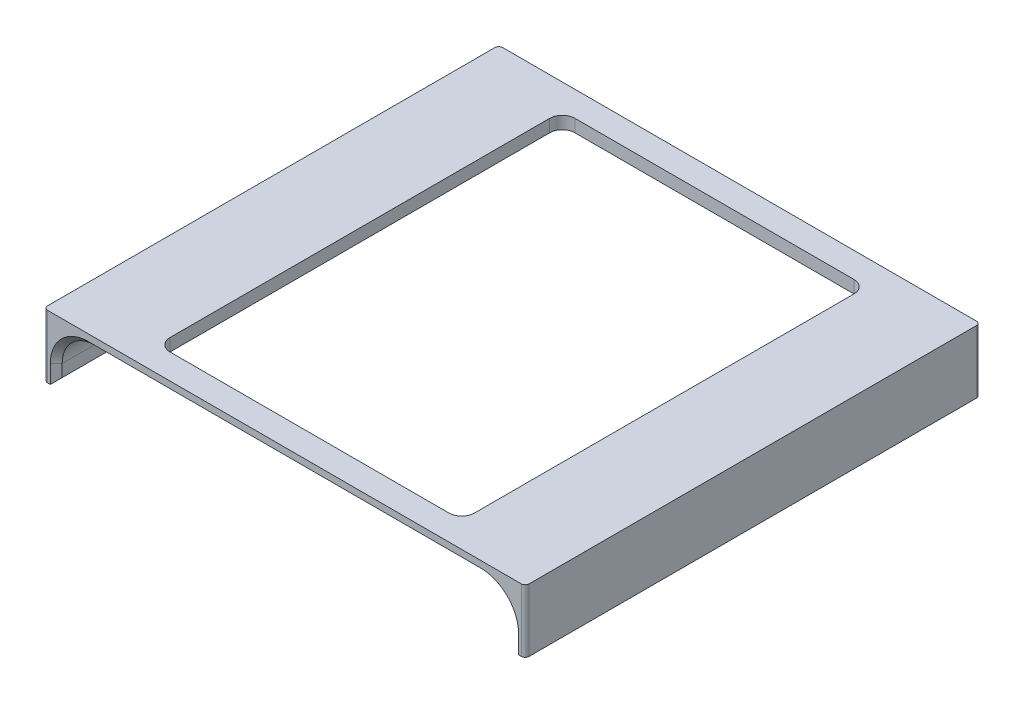
ISO-10303-21;
HEADER;
FILE_DESCRIPTION(('STEP AP214'),'2;1');
FILE_NAME('part.step','',(''),(''),'','','');
FILE_SCHEMA(('AUTOMOTIVE_DESIGN { 1 0 10303 214 1 1 1 1 }'));
ENDSEC;
DATA;
#1=APPLICATION_CONTEXT('core data for automotive mechanical design processes');
#2=APPLICATION_PROTOCOL_DEFINITION('international standard','automotive_design',2000,#1);
#3=PRODUCT_CONTEXT('',#1,'mechanical');
#4=PRODUCT('Part','Part','',(#3));
#5=PRODUCT_RELATED_PRODUCT_CATEGORY('part','',(#4));
#6=PRODUCT_DEFINITION_FORMATION('','',#4);
#7=PRODUCT_DEFINITION_CONTEXT('part definition',#1,'design');
#8=PRODUCT_DEFINITION('design','',#6,#7);
#9=PRODUCT_DEFINITION_SHAPE('','',#8);
#10=(LENGTH_UNIT() NAMED_UNIT(*) SI_UNIT(.MILLI.,.METRE.));
#11=(NAMED_UNIT(*) PLANE_ANGLE_UNIT() SI_UNIT($,.RADIAN.));
#12=(NAMED_UNIT(*) SI_UNIT($,.STERADIAN.) SOLID_ANGLE_UNIT());
#13=UNCERTAINTY_MEASURE_WITH_UNIT(LENGTH_MEASURE(1.E-05),#10,'distance_accuracy_value','');
#14=(GEOMETRIC_REPRESENTATION_CONTEXT(3) GLOBAL_UNCERTAINTY_ASSIGNED_CONTEXT((#13)) GLOBAL_UNIT_ASSIGNED_CONTEXT((#10,
#11,#12)) REPRESENTATION_CONTEXT('',''));
#15=CARTESIAN_POINT('',(0.,0.,0.));
#16=DIRECTION('',(0.,0.,1.));
#17=DIRECTION('',(1.,0.,0.));
#18=AXIS2_PLACEMENT_3D('',#15,#16,#17);
#19=CARTESIAN_POINT('',(0.,0.,0.));
#20=DIRECTION('',(0.,1.,0.));
#21=DIRECTION('',(0.,0.,1.));
#22=AXIS2_PLACEMENT_3D('',#19,#20,#21);
#23=PLANE('',#22);
#24=CARTESIAN_POINT('',(-35.2425,0.,-47.9425));
#25=DIRECTION('',(0.,1.,0.));
#26=DIRECTION('',(0.,0.,1.));
#27=AXIS2_PLACEMENT_3D('',#24,#25,#26);
#28=CIRCLE('',#27,3.17499999999999);
#29=CARTESIAN_POINT('',(-35.2425,0.,-51.1175));
#30=VERTEX_POINT('',#29);
#31=CARTESIAN_POINT('',(-38.4175,0.,-47.9425));
#32=VERTEX_POINT('',#31);
#33=EDGE_CURVE('E256',#30,#32,#28,.T.);
#34=ORIENTED_EDGE('',*,*,#33,.T.);
#35=DIRECTION('',(0.,0.,1.));
#36=VECTOR('',#35,1.);
#37=CARTESIAN_POINT('',(-38.4175,0.,0.));
#38=LINE('',#37,#36);
#39=CARTESIAN_POINT('',(-38.4175,0.,47.9425));
#40=VERTEX_POINT('',#39);
#41=EDGE_CURVE('E275',#32,#40,#38,.T.);
#42=ORIENTED_EDGE('',*,*,#41,.T.);
#43=CARTESIAN_POINT('',(-35.2425,0.,47.9425));
#44=DIRECTION('',(0.,1.,0.));
#45=DIRECTION('',(0.,0.,1.));
#46=AXIS2_PLACEMENT_3D('',#43,#44,#45);
#47=CIRCLE('',#46,3.17499999999999);
#48=CARTESIAN_POINT('',(-35.2425,0.,51.1175));
#49=VERTEX_POINT('',#48);
#50=EDGE_CURVE('E278',#40,#49,#47,.T.);
#51=ORIENTED_EDGE('',*,*,#50,.T.);
#52=DIRECTION('',(1.,0.,0.));
#53=VECTOR('',#52,1.);
#54=CARTESIAN_POINT('',(0.,0.,51.1175));
#55=LINE('',#54,#53);
#56=CARTESIAN_POINT('',(35.2425,0.,51.1175));
#57=VERTEX_POINT('',#56);
#58=EDGE_CURVE('E319',#49,#57,#55,.T.);
#59=ORIENTED_EDGE('',*,*,#58,.T.);
#60=CARTESIAN_POINT('',(35.2425,0.,47.9425));
#61=DIRECTION('',(0.,1.,0.));
#62=DIRECTION('',(0.,0.,1.));
#63=AXIS2_PLACEMENT_3D('',#60,#61,#62);
#64=CIRCLE('',#63,3.17499999999999);
#65=CARTESIAN_POINT('',(38.4175,0.,47.9425));
#66=VERTEX_POINT('',#65);
#67=EDGE_CURVE('E316',#57,#66,#64,.T.);
#68=ORIENTED_EDGE('',*,*,#67,.T.);
#69=DIRECTION('',(0.,0.,1.));
#70=VECTOR('',#69,1.);
#71=CARTESIAN_POINT('',(38.4175,0.,0.));
#72=LINE('',#71,#70);
#73=CARTESIAN_POINT('',(38.4175,0.,-47.9425));
#74=VERTEX_POINT('',#73);
#75=EDGE_CURVE('E313',#74,#66,#72,.T.);
#76=ORIENTED_EDGE('',*,*,#75,.F.);
#77=CARTESIAN_POINT('',(35.2425,0.,-47.9425));
#78=DIRECTION('',(0.,1.,0.));
#79=DIRECTION('',(0.,0.,1.));
#80=AXIS2_PLACEMENT_3D('',#77,#78,#79);
#81=CIRCLE('',#80,3.17499999999999);
#82=CARTESIAN_POINT('',(35.2425,0.,-51.1175));
#83=VERTEX_POINT('',#82);
#84=EDGE_CURVE('E311',#83,#74,#81,.F.);
#85=ORIENTED_EDGE('',*,*,#84,.F.);
#86=DIRECTION('',(1.,0.,0.));
#87=VECTOR('',#86,1.);
#88=CARTESIAN_POINT('',(0.,0.,-51.1175));
#89=LINE('',#88,#87);
#90=EDGE_CURVE('E308',#30,#83,#89,.T.);
#91=ORIENTED_EDGE('',*,*,#90,.F.);
#92=EDGE_LOOP('',(#34,#42,#51,#59,#68,#76,#85,#91));
#93=FACE_BOUND('',#92,.T.);
#94=DIRECTION('',(0.,0.,1.));
#95=VECTOR('',#94,1.);
#96=CARTESIAN_POINT('',(49.53254,0.,0.));
#97=LINE('',#96,#95);
#98=CARTESIAN_POINT('',(49.53254,0.,-55.9675));
#99=VERTEX_POINT('',#98);
#100=CARTESIAN_POINT('',(49.53254,0.,55.9675));
#101=VERTEX_POINT('',#100);
#102=EDGE_CURVE('E341',#99,#101,#97,.T.);
#103=ORIENTED_EDGE('',*,*,#102,.T.);
#104=DIRECTION('',(-1.,0.,0.));
#105=VECTOR('',#104,1.);
#106=CARTESIAN_POINT('',(0.,0.,55.9675));
#107=LINE('',#106,#105);
#108=CARTESIAN_POINT('',(-49.53254,0.,55.9675));
#109=VERTEX_POINT('',#108);
#110=EDGE_CURVE('E374',#101,#109,#107,.T.);
#111=ORIENTED_EDGE('',*,*,#110,.T.);
#112=DIRECTION('',(0.,0.,1.));
#113=VECTOR('',#112,1.);
#114=CARTESIAN_POINT('',(-49.53254,0.,-57.4675));
#115=LINE('',#114,#113);
#116=CARTESIAN_POINT('',(-49.53254,0.,-55.9675));
#117=VERTEX_POINT('',#116);
#118=EDGE_CURVE('E344',#109,#117,#115,.F.);
#119=ORIENTED_EDGE('',*,*,#118,.T.);
#120=DIRECTION('',(1.,0.,0.));
#121=VECTOR('',#120,1.);
#122=CARTESIAN_POINT('',(49.53254,0.,-55.9675));
#123=LINE('',#122,#121);
#124=EDGE_CURVE('E372',#117,#99,#123,.T.);
#125=ORIENTED_EDGE('',*,*,#124,.T.);
#126=EDGE_LOOP('',(#103,#111,#119,#125));
#127=FACE_BOUND('',#126,.T.);
#128=ADVANCED_FACE('F63',(#93,#127),#23,.F.);
#129=CARTESIAN_POINT('',(0.,3.175,-57.4675));
#130=DIRECTION('',(0.,0.,-1.));
#131=DIRECTION('',(-1.,0.,0.));
#132=AXIS2_PLACEMENT_3D('',#129,#130,#131);
#133=PLANE('',#132);
#134=DIRECTION('',(-1.,0.,0.));
#135=VECTOR('',#134,1.);
#136=CARTESIAN_POINT('',(0.,-12.7,-57.4675));
#137=LINE('',#136,#135);
#138=CARTESIAN_POINT('',(-59.1326,-12.7,-57.4675));
#139=VERTEX_POINT('',#138);
#140=CARTESIAN_POINT('',(-59.8076,-12.7,-57.4675));
#141=VERTEX_POINT('',#140);
#142=EDGE_CURVE('E435',#139,#141,#137,.T.);
#143=ORIENTED_EDGE('',*,*,#142,.T.);
#144=DIRECTION('',(0.,-1.,0.));
#145=VECTOR('',#144,1.);
#146=CARTESIAN_POINT('',(-59.8076,3.175,-57.4675));
#147=LINE('',#146,#145);
#148=CARTESIAN_POINT('',(-59.8076,3.175,-57.4675));
#149=VERTEX_POINT('',#148);
#150=EDGE_CURVE('E460',#141,#149,#147,.F.);
#151=ORIENTED_EDGE('',*,*,#150,.T.);
#152=DIRECTION('',(1.,0.,0.));
#153=VECTOR('',#152,1.);
#154=CARTESIAN_POINT('',(0.,3.175,-57.4675));
#155=LINE('',#154,#153);
#156=CARTESIAN_POINT('',(59.8076,3.175,-57.4675));
#157=VERTEX_POINT('',#156);
#158=EDGE_CURVE('E297',#149,#157,#155,.T.);
#159=ORIENTED_EDGE('',*,*,#158,.T.);
#160=DIRECTION('',(0.,-1.,0.));
#161=VECTOR('',#160,1.);
#162=CARTESIAN_POINT('',(59.8076,3.175,-57.4675));
#163=LINE('',#162,#161);
#164=CARTESIAN_POINT('',(59.8076,-12.7,-57.4675));
#165=VERTEX_POINT('',#164);
#166=EDGE_CURVE('E457',#157,#165,#163,.T.);
#167=ORIENTED_EDGE('',*,*,#166,.T.);
#168=DIRECTION('',(1.,0.,0.));
#169=VECTOR('',#168,1.);
#170=CARTESIAN_POINT('',(-2.51187959321441E-13,-12.7,-57.4674999999998));
#171=LINE('',#170,#169);
#172=CARTESIAN_POINT('',(59.1326,-12.7,-57.4675));
#173=VERTEX_POINT('',#172);
#174=EDGE_CURVE('E472',#173,#165,#171,.T.);
#175=ORIENTED_EDGE('',*,*,#174,.F.);
#176=DIRECTION('',(0.,1.,0.));
#177=VECTOR('',#176,1.);
#178=CARTESIAN_POINT('',(59.1326,3.175,-57.4675));
#179=LINE('',#178,#177);
#180=CARTESIAN_POINT('',(59.1326,-8.10006,-57.4675));
#181=VERTEX_POINT('',#180);
#182=EDGE_CURVE('E396',#173,#181,#179,.T.);
#183=ORIENTED_EDGE('',*,*,#182,.T.);
#184=CARTESIAN_POINT('',(49.53254,-8.10006,-57.4675));
#185=DIRECTION('',(0.,0.,-1.));
#186=DIRECTION('',(-1.,0.,0.));
#187=AXIS2_PLACEMENT_3D('',#184,#185,#186);
#188=CIRCLE('',#187,9.60006);
#189=CARTESIAN_POINT('',(49.53254,1.5,-57.4675));
#190=VERTEX_POINT('',#189);
#191=EDGE_CURVE('E394',#181,#190,#188,.F.);
#192=ORIENTED_EDGE('',*,*,#191,.T.);
#193=DIRECTION('',(-1.,0.,0.));
#194=VECTOR('',#193,1.);
#195=CARTESIAN_POINT('',(-49.53254,1.5,-57.4675));
#196=LINE('',#195,#194);
#197=CARTESIAN_POINT('',(-49.53254,1.5,-57.4675));
#198=VERTEX_POINT('',#197);
#199=EDGE_CURVE('E392',#190,#198,#196,.T.);
#200=ORIENTED_EDGE('',*,*,#199,.T.);
#201=CARTESIAN_POINT('',(-49.53254,-8.10006,-57.4675));
#202=DIRECTION('',(0.,0.,-1.));
#203=DIRECTION('',(-1.,0.,0.));
#204=AXIS2_PLACEMENT_3D('',#201,#202,#203);
#205=CIRCLE('',#204,9.60006);
#206=CARTESIAN_POINT('',(-59.1326,-8.10006,-57.4675));
#207=VERTEX_POINT('',#206);
#208=EDGE_CURVE('E390',#198,#207,#205,.F.);
#209=ORIENTED_EDGE('',*,*,#208,.T.);
#210=DIRECTION('',(0.,-1.,0.));
#211=VECTOR('',#210,1.);
#212=CARTESIAN_POINT('',(-59.1326,-12.7,-57.4675));
#213=LINE('',#212,#211);
#214=EDGE_CURVE('E388',#207,#139,#213,.T.);
#215=ORIENTED_EDGE('',*,*,#214,.T.);
#216=EDGE_LOOP('',(#143,#151,#159,#167,#175,#183,#192,#200,#209,#215));
#217=FACE_BOUND('',#216,.T.);
#218=ADVANCED_FACE('F485',(#217),#133,.T.);
#219=CARTESIAN_POINT('',(-60.8076,3.175,0.));
#220=DIRECTION('',(1.,0.,0.));
#221=DIRECTION('',(0.,0.,-1.));
#222=AXIS2_PLACEMENT_3D('',#219,#220,#221);
#223=PLANE('',#222);
#224=DIRECTION('',(0.,0.,1.));
#225=VECTOR('',#224,1.);
#226=CARTESIAN_POINT('',(-60.8076,-12.7,0.));
#227=LINE('',#226,#225);
#228=CARTESIAN_POINT('',(-60.8076,-12.7,-56.4675));
#229=VERTEX_POINT('',#228);
#230=CARTESIAN_POINT('',(-60.8076,-12.7,56.4675));
#231=VERTEX_POINT('',#230);
#232=EDGE_CURVE('E476',#229,#231,#227,.T.);
#233=ORIENTED_EDGE('',*,*,#232,.T.);
#234=DIRECTION('',(0.,-1.,0.));
#235=VECTOR('',#234,1.);
#236=CARTESIAN_POINT('',(-60.8076,3.175,56.4675));
#237=LINE('',#236,#235);
#238=CARTESIAN_POINT('',(-60.8076,3.175,56.4675));
#239=VERTEX_POINT('',#238);
#240=EDGE_CURVE('E447',#231,#239,#237,.F.);
#241=ORIENTED_EDGE('',*,*,#240,.T.);
#242=DIRECTION('',(0.,0.,1.));
#243=VECTOR('',#242,1.);
#244=CARTESIAN_POINT('',(-60.8076,3.175,0.));
#245=LINE('',#244,#243);
#246=CARTESIAN_POINT('',(-60.8076,3.175,-56.4675));
#247=VERTEX_POINT('',#246);
#248=EDGE_CURVE('E300',#247,#239,#245,.T.);
#249=ORIENTED_EDGE('',*,*,#248,.F.);
#250=DIRECTION('',(0.,-1.,0.));
#251=VECTOR('',#250,1.);
#252=CARTESIAN_POINT('',(-60.8076,-12.7,-56.4675));
#253=LINE('',#252,#251);
#254=EDGE_CURVE('E444',#247,#229,#253,.T.);
#255=ORIENTED_EDGE('',*,*,#254,.T.);
#256=EDGE_LOOP('',(#233,#241,#249,#255));
#257=FACE_BOUND('',#256,.T.);
#258=ADVANCED_FACE('F497',(#257),#223,.F.);
#259=CARTESIAN_POINT('',(-35.2425,3.175,-47.9425));
#260=DIRECTION('',(0.,-1.,0.));
#261=DIRECTION('',(0.,0.,-1.));
#262=AXIS2_PLACEMENT_3D('',#259,#260,#261);
#263=CYLINDRICAL_SURFACE('',#262,3.17499999999999);
#264=ORIENTED_EDGE('',*,*,#33,.F.);
#265=DIRECTION('',(0.,-1.,0.));
#266=VECTOR('',#265,1.);
#267=CARTESIAN_POINT('',(-35.2425,3.175,-51.1175));
#268=LINE('',#267,#266);
#269=CARTESIAN_POINT('',(-35.2425,3.175,-51.1175));
#270=VERTEX_POINT('',#269);
#271=EDGE_CURVE('E249',#270,#30,#268,.T.);
#272=ORIENTED_EDGE('',*,*,#271,.F.);
#273=CARTESIAN_POINT('',(-35.2425,3.175,-47.9425));
#274=DIRECTION('',(0.,1.,0.));
#275=DIRECTION('',(0.,0.,1.));
#276=AXIS2_PLACEMENT_3D('',#273,#274,#275);
#277=CIRCLE('',#276,3.17499999999999);
#278=CARTESIAN_POINT('',(-38.4175,3.175,-47.9425));
#279=VERTEX_POINT('',#278);
#280=EDGE_CURVE('E253',#270,#279,#277,.T.);
#281=ORIENTED_EDGE('',*,*,#280,.T.);
#282=DIRECTION('',(0.,-1.,0.));
#283=VECTOR('',#282,1.);
#284=CARTESIAN_POINT('',(-38.4175,3.175,-47.9425));
#285=LINE('',#284,#283);
#286=EDGE_CURVE('E306',#279,#32,#285,.T.);
#287=ORIENTED_EDGE('',*,*,#286,.T.);
#288=EDGE_LOOP('',(#264,#272,#281,#287));
#289=FACE_BOUND('',#288,.T.);
#290=ADVANCED_FACE('F251',(#289),#263,.F.);
#291=CARTESIAN_POINT('',(0.,3.175,-51.1175));
#292=DIRECTION('',(0.,0.,-1.));
#293=DIRECTION('',(-1.,0.,0.));
#294=AXIS2_PLACEMENT_3D('',#291,#292,#293);
#295=PLANE('',#294);
#296=ORIENTED_EDGE('',*,*,#90,.T.);
#297=DIRECTION('',(0.,-1.,0.));
#298=VECTOR('',#297,1.);
#299=CARTESIAN_POINT('',(35.2425,3.175,-51.1175));
#300=LINE('',#299,#298);
#301=CARTESIAN_POINT('',(35.2425,3.175,-51.1175));
#302=VERTEX_POINT('',#301);
#303=EDGE_CURVE('E260',#302,#83,#300,.T.);
#304=ORIENTED_EDGE('',*,*,#303,.F.);
#305=DIRECTION('',(1.,0.,0.));
#306=VECTOR('',#305,1.);
#307=CARTESIAN_POINT('',(0.,3.175,-51.1175));
#308=LINE('',#307,#306);
#309=EDGE_CURVE('E263',#270,#302,#308,.T.);
#310=ORIENTED_EDGE('',*,*,#309,.F.);
#311=ORIENTED_EDGE('',*,*,#271,.T.);
#312=EDGE_LOOP('',(#296,#304,#310,#311));
#313=FACE_BOUND('',#312,.T.);
#314=ADVANCED_FACE('F264',(#313),#295,.F.);
#315=CARTESIAN_POINT('',(35.2425,3.175,-47.9425));
#316=DIRECTION('',(0.,-1.,0.));
#317=DIRECTION('',(0.,0.,-1.));
#318=AXIS2_PLACEMENT_3D('',#315,#316,#317);
#319=CYLINDRICAL_SURFACE('',#318,3.17499999999999);
#320=ORIENTED_EDGE('',*,*,#84,.T.);
#321=DIRECTION('',(0.,-1.,0.));
#322=VECTOR('',#321,1.);
#323=CARTESIAN_POINT('',(38.4175,3.175,-47.9425));
#324=LINE('',#323,#322);
#325=CARTESIAN_POINT('',(38.4175,3.175,-47.9425));
#326=VERTEX_POINT('',#325);
#327=EDGE_CURVE('E333',#326,#74,#324,.T.);
#328=ORIENTED_EDGE('',*,*,#327,.F.);
#329=CARTESIAN_POINT('',(35.2425,3.175,-47.9425));
#330=DIRECTION('',(0.,1.,0.));
#331=DIRECTION('',(0.,0.,1.));
#332=AXIS2_PLACEMENT_3D('',#329,#330,#331);
#333=CIRCLE('',#332,3.17499999999999);
#334=EDGE_CURVE('E268',#302,#326,#333,.F.);
#335=ORIENTED_EDGE('',*,*,#334,.F.);
#336=ORIENTED_EDGE('',*,*,#303,.T.);
#337=EDGE_LOOP('',(#320,#328,#335,#336));
#338=FACE_BOUND('',#337,.T.);
#339=ADVANCED_FACE('F844',(#338),#319,.F.);
#340=CARTESIAN_POINT('',(38.4175,3.175,0.));
#341=DIRECTION('',(1.,0.,0.));
#342=DIRECTION('',(0.,0.,-1.));
#343=AXIS2_PLACEMENT_3D('',#340,#341,#342);
#344=PLANE('',#343);
#345=ORIENTED_EDGE('',*,*,#75,.T.);
#346=DIRECTION('',(0.,-1.,0.));
#347=VECTOR('',#346,1.);
#348=CARTESIAN_POINT('',(38.4175,3.175,47.9425));
#349=LINE('',#348,#347);
#350=CARTESIAN_POINT('',(38.4175,3.175,47.9425));
#351=VERTEX_POINT('',#350);
#352=EDGE_CURVE('E331',#351,#66,#349,.T.);
#353=ORIENTED_EDGE('',*,*,#352,.F.);
#354=DIRECTION('',(0.,0.,1.));
#355=VECTOR('',#354,1.);
#356=CARTESIAN_POINT('',(38.4175,3.175,0.));
#357=LINE('',#356,#355);
#358=EDGE_CURVE('E285',#326,#351,#357,.T.);
#359=ORIENTED_EDGE('',*,*,#358,.F.);
#360=ORIENTED_EDGE('',*,*,#327,.T.);
#361=EDGE_LOOP('',(#345,#353,#359,#360));
#362=FACE_BOUND('',#361,.T.);
#363=ADVANCED_FACE('F834',(#362),#344,.F.);
#364=CARTESIAN_POINT('',(35.2425,3.175,47.9425));
#365=DIRECTION('',(0.,-1.,0.));
#366=DIRECTION('',(0.,0.,-1.));
#367=AXIS2_PLACEMENT_3D('',#364,#365,#366);
#368=CYLINDRICAL_SURFACE('',#367,3.17499999999999);
#369=ORIENTED_EDGE('',*,*,#67,.F.);
#370=DIRECTION('',(0.,-1.,0.));
#371=VECTOR('',#370,1.);
#372=CARTESIAN_POINT('',(35.2425,3.175,51.1175));
#373=LINE('',#372,#371);
#374=CARTESIAN_POINT('',(35.2425,3.175,51.1175));
#375=VERTEX_POINT('',#374);
#376=EDGE_CURVE('E329',#375,#57,#373,.T.);
#377=ORIENTED_EDGE('',*,*,#376,.F.);
#378=CARTESIAN_POINT('',(35.2425,3.175,47.9425));
#379=DIRECTION('',(0.,1.,0.));
#380=DIRECTION('',(0.,0.,1.));
#381=AXIS2_PLACEMENT_3D('',#378,#379,#380);
#382=CIRCLE('',#381,3.17499999999999);
#383=EDGE_CURVE('E287',#375,#351,#382,.T.);
#384=ORIENTED_EDGE('',*,*,#383,.T.);
#385=ORIENTED_EDGE('',*,*,#352,.T.);
#386=EDGE_LOOP('',(#369,#377,#384,#385));
#387=FACE_BOUND('',#386,.T.);
#388=ADVANCED_FACE('F824',(#387),#368,.F.);
#389=CARTESIAN_POINT('',(0.,3.175,51.1175));
#390=DIRECTION('',(0.,0.,-1.));
#391=DIRECTION('',(-1.,0.,0.));
#392=AXIS2_PLACEMENT_3D('',#389,#390,#391);
#393=PLANE('',#392);
#394=ORIENTED_EDGE('',*,*,#58,.F.);
#395=DIRECTION('',(0.,-1.,0.));
#396=VECTOR('',#395,1.);
#397=CARTESIAN_POINT('',(-35.2425,3.175,51.1175));
#398=LINE('',#397,#396);
#399=CARTESIAN_POINT('',(-35.2425,3.175,51.1175));
#400=VERTEX_POINT('',#399);
#401=EDGE_CURVE('E327',#400,#49,#398,.T.);
#402=ORIENTED_EDGE('',*,*,#401,.F.);
#403=DIRECTION('',(1.,0.,0.));
#404=VECTOR('',#403,1.);
#405=CARTESIAN_POINT('',(0.,3.175,51.1175));
#406=LINE('',#405,#404);
#407=EDGE_CURVE('E290',#400,#375,#406,.T.);
#408=ORIENTED_EDGE('',*,*,#407,.T.);
#409=ORIENTED_EDGE('',*,*,#376,.T.);
#410=EDGE_LOOP('',(#394,#402,#408,#409));
#411=FACE_BOUND('',#410,.T.);
#412=ADVANCED_FACE('F814',(#411),#393,.T.);
#413=CARTESIAN_POINT('',(-35.2425,3.175,47.9425));
#414=DIRECTION('',(0.,-1.,0.));
#415=DIRECTION('',(0.,0.,-1.));
#416=AXIS2_PLACEMENT_3D('',#413,#414,#415);
#417=CYLINDRICAL_SURFACE('',#416,3.17499999999999);
#418=ORIENTED_EDGE('',*,*,#50,.F.);
#419=DIRECTION('',(0.,-1.,0.));
#420=VECTOR('',#419,1.);
#421=CARTESIAN_POINT('',(-38.4175,3.175,47.9425));
#422=LINE('',#421,#420);
#423=CARTESIAN_POINT('',(-38.4175,3.175,47.9425));
#424=VERTEX_POINT('',#423);
#425=EDGE_CURVE('E325',#424,#40,#422,.T.);
#426=ORIENTED_EDGE('',*,*,#425,.F.);
#427=CARTESIAN_POINT('',(-35.2425,3.175,47.9425));
#428=DIRECTION('',(0.,1.,0.));
#429=DIRECTION('',(0.,0.,1.));
#430=AXIS2_PLACEMENT_3D('',#427,#428,#429);
#431=CIRCLE('',#430,3.17499999999999);
#432=EDGE_CURVE('E293',#424,#400,#431,.T.);
#433=ORIENTED_EDGE('',*,*,#432,.T.);
#434=ORIENTED_EDGE('',*,*,#401,.T.);
#435=EDGE_LOOP('',(#418,#426,#433,#434));
#436=FACE_BOUND('',#435,.T.);
#437=ADVANCED_FACE('F802',(#436),#417,.F.);
#438=CARTESIAN_POINT('',(-38.4175,3.175,0.));
#439=DIRECTION('',(1.,0.,0.));
#440=DIRECTION('',(0.,0.,-1.));
#441=AXIS2_PLACEMENT_3D('',#438,#439,#440);
#442=PLANE('',#441);
#443=ORIENTED_EDGE('',*,*,#41,.F.);
#444=ORIENTED_EDGE('',*,*,#286,.F.);
#445=DIRECTION('',(0.,0.,1.));
#446=VECTOR('',#445,1.);
#447=CARTESIAN_POINT('',(-38.4175,3.175,0.));
#448=LINE('',#447,#446);
#449=EDGE_CURVE('E274',#279,#424,#448,.T.);
#450=ORIENTED_EDGE('',*,*,#449,.T.);
#451=ORIENTED_EDGE('',*,*,#425,.T.);
#452=EDGE_LOOP('',(#443,#444,#450,#451));
#453=FACE_BOUND('',#452,.T.);
#454=ADVANCED_FACE('F797',(#453),#442,.T.);
#455=CARTESIAN_POINT('',(0.,3.175,57.4675));
#456=DIRECTION('',(0.,0.,-1.));
#457=DIRECTION('',(-1.,0.,0.));
#458=AXIS2_PLACEMENT_3D('',#455,#456,#457);
#459=PLANE('',#458);
#460=DIRECTION('',(1.,0.,0.));
#461=VECTOR('',#460,1.);
#462=CARTESIAN_POINT('',(0.,3.175,57.4675));
#463=LINE('',#462,#461);
#464=CARTESIAN_POINT('',(-59.8076,3.175,57.4675));
#465=VERTEX_POINT('',#464);
#466=CARTESIAN_POINT('',(59.8076,3.175,57.4675));
#467=VERTEX_POINT('',#466);
#468=EDGE_CURVE('E303',#465,#467,#463,.T.);
#469=ORIENTED_EDGE('',*,*,#468,.F.);
#470=DIRECTION('',(0.,-1.,0.));
#471=VECTOR('',#470,1.);
#472=CARTESIAN_POINT('',(-59.8076,3.175,57.4675));
#473=LINE('',#472,#471);
#474=CARTESIAN_POINT('',(-59.8076,-12.7,57.4675));
#475=VERTEX_POINT('',#474);
#476=EDGE_CURVE('E437',#465,#475,#473,.T.);
#477=ORIENTED_EDGE('',*,*,#476,.T.);
#478=DIRECTION('',(-1.,0.,0.));
#479=VECTOR('',#478,1.);
#480=CARTESIAN_POINT('',(0.,-12.7,57.4675));
#481=LINE('',#480,#479);
#482=CARTESIAN_POINT('',(-59.1326,-12.7,57.4675));
#483=VERTEX_POINT('',#482);
#484=EDGE_CURVE('E473',#483,#475,#481,.T.);
#485=ORIENTED_EDGE('',*,*,#484,.F.);
#486=DIRECTION('',(0.,1.,0.));
#487=VECTOR('',#486,1.);
#488=CARTESIAN_POINT('',(-59.1326,3.175,57.4675));
#489=LINE('',#488,#487);
#490=CARTESIAN_POINT('',(-59.1326,-8.10006,57.4675));
#491=VERTEX_POINT('',#490);
#492=EDGE_CURVE('E358',#483,#491,#489,.T.);
#493=ORIENTED_EDGE('',*,*,#492,.T.);
#494=CARTESIAN_POINT('',(-49.53254,-8.10006,57.4675));
#495=DIRECTION('',(0.,0.,-1.));
#496=DIRECTION('',(-1.,0.,0.));
#497=AXIS2_PLACEMENT_3D('',#494,#495,#496);
#498=CIRCLE('',#497,9.60006);
#499=CARTESIAN_POINT('',(-49.53254,1.5,57.4675));
#500=VERTEX_POINT('',#499);
#501=EDGE_CURVE('E356',#491,#500,#498,.T.);
#502=ORIENTED_EDGE('',*,*,#501,.T.);
#503=DIRECTION('',(1.,0.,0.));
#504=VECTOR('',#503,1.);
#505=CARTESIAN_POINT('',(0.,1.5,57.4675));
#506=LINE('',#505,#504);
#507=CARTESIAN_POINT('',(49.53254,1.5,57.4675));
#508=VERTEX_POINT('',#507);
#509=EDGE_CURVE('E354',#500,#508,#506,.T.);
#510=ORIENTED_EDGE('',*,*,#509,.T.);
#511=CARTESIAN_POINT('',(49.53254,-8.10006,57.4675));
#512=DIRECTION('',(0.,0.,-1.));
#513=DIRECTION('',(-1.,0.,0.));
#514=AXIS2_PLACEMENT_3D('',#511,#512,#513);
#515=CIRCLE('',#514,9.60006);
#516=CARTESIAN_POINT('',(59.1326,-8.10006,57.4675));
#517=VERTEX_POINT('',#516);
#518=EDGE_CURVE('E352',#508,#517,#515,.T.);
#519=ORIENTED_EDGE('',*,*,#518,.T.);
#520=DIRECTION('',(0.,-1.,0.));
#521=VECTOR('',#520,1.);
#522=CARTESIAN_POINT('',(59.1326,-12.7,57.4675));
#523=LINE('',#522,#521);
#524=CARTESIAN_POINT('',(59.1326,-12.7,57.4675));
#525=VERTEX_POINT('',#524);
#526=EDGE_CURVE('E350',#517,#525,#523,.T.);
#527=ORIENTED_EDGE('',*,*,#526,.T.);
#528=DIRECTION('',(1.,0.,0.));
#529=VECTOR('',#528,1.);
#530=CARTESIAN_POINT('',(2.51187959321441E-13,-12.7,57.4675000000003));
#531=LINE('',#530,#529);
#532=CARTESIAN_POINT('',(59.8076,-12.7,57.4675));
#533=VERTEX_POINT('',#532);
#534=EDGE_CURVE('E281',#525,#533,#531,.T.);
#535=ORIENTED_EDGE('',*,*,#534,.T.);
#536=DIRECTION('',(0.,-1.,0.));
#537=VECTOR('',#536,1.);
#538=CARTESIAN_POINT('',(59.8076,3.175,57.4675));
#539=LINE('',#538,#537);
#540=EDGE_CURVE('E400',#533,#467,#539,.F.);
#541=ORIENTED_EDGE('',*,*,#540,.T.);
#542=EDGE_LOOP('',(#469,#477,#485,#493,#502,#510,#519,#527,#535,#541));
#543=FACE_BOUND('',#542,.T.);
#544=ADVANCED_FACE('F505',(#543),#459,.F.);
#545=CARTESIAN_POINT('',(0.,3.175,0.));
#546=DIRECTION('',(0.,1.,0.));
#547=DIRECTION('',(0.,0.,1.));
#548=AXIS2_PLACEMENT_3D('',#545,#546,#547);
#549=PLANE('',#548);
#550=ORIENTED_EDGE('',*,*,#280,.F.);
#551=ORIENTED_EDGE('',*,*,#309,.T.);
#552=ORIENTED_EDGE('',*,*,#334,.T.);
#553=ORIENTED_EDGE('',*,*,#358,.T.);
#554=ORIENTED_EDGE('',*,*,#383,.F.);
#555=ORIENTED_EDGE('',*,*,#407,.F.);
#556=ORIENTED_EDGE('',*,*,#432,.F.);
#557=ORIENTED_EDGE('',*,*,#449,.F.);
#558=EDGE_LOOP('',(#550,#551,#552,#553,#554,#555,#556,#557));
#559=FACE_BOUND('',#558,.T.);
#560=ORIENTED_EDGE('',*,*,#248,.T.);
#561=CARTESIAN_POINT('',(-59.8076,3.175,56.4675));
#562=DIRECTION('',(0.,1.,0.));
#563=DIRECTION('',(0.,0.,1.));
#564=AXIS2_PLACEMENT_3D('',#561,#562,#563);
#565=CIRCLE('',#564,1.);
#566=EDGE_CURVE('E455',#239,#465,#565,.T.);
#567=ORIENTED_EDGE('',*,*,#566,.T.);
#568=ORIENTED_EDGE('',*,*,#468,.T.);
#569=CARTESIAN_POINT('',(59.8076,3.175,56.4675));
#570=DIRECTION('',(0.,1.,0.));
#571=DIRECTION('',(0.,0.,1.));
#572=AXIS2_PLACEMENT_3D('',#569,#570,#571);
#573=CIRCLE('',#572,1.);
#574=CARTESIAN_POINT('',(60.8076,3.175,56.4675));
#575=VERTEX_POINT('',#574);
#576=EDGE_CURVE('E449',#467,#575,#573,.T.);
#577=ORIENTED_EDGE('',*,*,#576,.T.);
#578=DIRECTION('',(0.,0.,1.));
#579=VECTOR('',#578,1.);
#580=CARTESIAN_POINT('',(60.8076,3.175,-57.4675));
#581=LINE('',#580,#579);
#582=CARTESIAN_POINT('',(60.8076,3.175,-56.4675));
#583=VERTEX_POINT('',#582);
#584=EDGE_CURVE('E309',#583,#575,#581,.T.);
#585=ORIENTED_EDGE('',*,*,#584,.F.);
#586=CARTESIAN_POINT('',(59.8076,3.175,-56.4675));
#587=DIRECTION('',(0.,1.,0.));
#588=DIRECTION('',(0.,0.,1.));
#589=AXIS2_PLACEMENT_3D('',#586,#587,#588);
#590=CIRCLE('',#589,1.);
#591=EDGE_CURVE('E451',#583,#157,#590,.T.);
#592=ORIENTED_EDGE('',*,*,#591,.T.);
#593=ORIENTED_EDGE('',*,*,#158,.F.);
#594=CARTESIAN_POINT('',(-59.8076,3.175,-56.4675));
#595=DIRECTION('',(0.,1.,0.));
#596=DIRECTION('',(0.,0.,1.));
#597=AXIS2_PLACEMENT_3D('',#594,#595,#596);
#598=CIRCLE('',#597,1.);
#599=EDGE_CURVE('E453',#149,#247,#598,.T.);
#600=ORIENTED_EDGE('',*,*,#599,.T.);
#601=EDGE_LOOP('',(#560,#567,#568,#577,#585,#592,#593,#600));
#602=FACE_BOUND('',#601,.T.);
#603=ADVANCED_FACE('F270',(#559,#602),#549,.T.);
#604=CARTESIAN_POINT('',(60.8076,3.175,-57.4675));
#605=DIRECTION('',(1.,0.,0.));
#606=DIRECTION('',(0.,0.,-1.));
#607=AXIS2_PLACEMENT_3D('',#604,#605,#606);
#608=PLANE('',#607);
#609=DIRECTION('',(0.,0.,1.));
#610=VECTOR('',#609,1.);
#611=CARTESIAN_POINT('',(60.8076,-12.7,0.));
#612=LINE('',#611,#610);
#613=CARTESIAN_POINT('',(60.8076,-12.7,-56.4675));
#614=VERTEX_POINT('',#613);
#615=CARTESIAN_POINT('',(60.8076,-12.7,56.4675));
#616=VERTEX_POINT('',#615);
#617=EDGE_CURVE('E465',#614,#616,#612,.T.);
#618=ORIENTED_EDGE('',*,*,#617,.F.);
#619=DIRECTION('',(0.,-1.,0.));
#620=VECTOR('',#619,1.);
#621=CARTESIAN_POINT('',(60.8076,3.175,-56.4675));
#622=LINE('',#621,#620);
#623=EDGE_CURVE('E12',#614,#583,#622,.F.);
#624=ORIENTED_EDGE('',*,*,#623,.T.);
#625=ORIENTED_EDGE('',*,*,#584,.T.);
#626=DIRECTION('',(0.,-1.,0.));
#627=VECTOR('',#626,1.);
#628=CARTESIAN_POINT('',(60.8076,-12.7,56.4675));
#629=LINE('',#628,#627);
#630=EDGE_CURVE('E71',#575,#616,#629,.T.);
#631=ORIENTED_EDGE('',*,*,#630,.T.);
#632=EDGE_LOOP('',(#618,#624,#625,#631));
#633=FACE_BOUND('',#632,.T.);
#634=ADVANCED_FACE('F464',(#633),#608,.T.);
#635=CARTESIAN_POINT('',(57.6326,-12.7,0.));
#636=DIRECTION('',(-1.,0.,0.));
#637=DIRECTION('',(0.,0.,1.));
#638=AXIS2_PLACEMENT_3D('',#635,#636,#637);
#639=PLANE('',#638);
#640=DIRECTION('',(0.,0.,1.));
#641=VECTOR('',#640,1.);
#642=CARTESIAN_POINT('',(57.6326,-11.2,57.4675));
#643=LINE('',#642,#641);
#644=CARTESIAN_POINT('',(57.6326,-11.2,-55.9675));
#645=VERTEX_POINT('',#644);
#646=CARTESIAN_POINT('',(57.6326,-11.2,55.9675));
#647=VERTEX_POINT('',#646);
#648=EDGE_CURVE('E382',#645,#647,#643,.T.);
#649=ORIENTED_EDGE('',*,*,#648,.T.);
#650=DIRECTION('',(0.,1.,0.));
#651=VECTOR('',#650,1.);
#652=CARTESIAN_POINT('',(57.6326,-8.10006,55.9675));
#653=LINE('',#652,#651);
#654=CARTESIAN_POINT('',(57.6326,-8.10006,55.9675));
#655=VERTEX_POINT('',#654);
#656=EDGE_CURVE('E384',#647,#655,#653,.T.);
#657=ORIENTED_EDGE('',*,*,#656,.T.);
#658=DIRECTION('',(0.,0.,1.));
#659=VECTOR('',#658,1.);
#660=CARTESIAN_POINT('',(57.6326,-8.10006,0.));
#661=LINE('',#660,#659);
#662=CARTESIAN_POINT('',(57.6326,-8.10006,-55.9675));
#663=VERTEX_POINT('',#662);
#664=EDGE_CURVE('E347',#655,#663,#661,.F.);
#665=ORIENTED_EDGE('',*,*,#664,.T.);
#666=DIRECTION('',(0.,-1.,0.));
#667=VECTOR('',#666,1.);
#668=CARTESIAN_POINT('',(57.6326,-12.7,-55.9675));
#669=LINE('',#668,#667);
#670=EDGE_CURVE('E380',#663,#645,#669,.T.);
#671=ORIENTED_EDGE('',*,*,#670,.T.);
#672=EDGE_LOOP('',(#649,#657,#665,#671));
#673=FACE_BOUND('',#672,.T.);
#674=ADVANCED_FACE('F527',(#673),#639,.T.);
#675=CARTESIAN_POINT('',(0.,-12.7,0.));
#676=DIRECTION('',(0.,1.,0.));
#677=DIRECTION('',(0.,0.,1.));
#678=AXIS2_PLACEMENT_3D('',#675,#676,#677);
#679=PLANE('',#678);
#680=ORIENTED_EDGE('',*,*,#174,.T.);
#681=CARTESIAN_POINT('',(59.8076,-12.7,-56.4675));
#682=DIRECTION('',(0.,1.,0.));
#683=DIRECTION('',(0.,0.,1.));
#684=AXIS2_PLACEMENT_3D('',#681,#682,#683);
#685=CIRCLE('',#684,1.);
#686=EDGE_CURVE('E86',#165,#614,#685,.F.);
#687=ORIENTED_EDGE('',*,*,#686,.T.);
#688=ORIENTED_EDGE('',*,*,#617,.T.);
#689=CARTESIAN_POINT('',(59.8076,-12.7,56.4675));
#690=DIRECTION('',(0.,1.,0.));
#691=DIRECTION('',(0.,0.,1.));
#692=AXIS2_PLACEMENT_3D('',#689,#690,#691);
#693=CIRCLE('',#692,1.);
#694=EDGE_CURVE('E78',#616,#533,#693,.F.);
#695=ORIENTED_EDGE('',*,*,#694,.T.);
#696=ORIENTED_EDGE('',*,*,#534,.F.);
#697=DIRECTION('',(0.,0.,-1.));
#698=VECTOR('',#697,1.);
#699=CARTESIAN_POINT('',(59.1326,-12.7,-57.4675));
#700=LINE('',#699,#698);
#701=EDGE_CURVE('E386',#525,#173,#700,.T.);
#702=ORIENTED_EDGE('',*,*,#701,.T.);
#703=EDGE_LOOP('',(#680,#687,#688,#695,#696,#702));
#704=FACE_BOUND('',#703,.T.);
#705=ADVANCED_FACE('F469',(#704),#679,.F.);
#706=CARTESIAN_POINT('',(-57.6326,-12.7,0.));
#707=DIRECTION('',(-1.,0.,0.));
#708=DIRECTION('',(0.,0.,1.));
#709=AXIS2_PLACEMENT_3D('',#706,#707,#708);
#710=PLANE('',#709);
#711=DIRECTION('',(0.,0.,1.));
#712=VECTOR('',#711,1.);
#713=CARTESIAN_POINT('',(-57.6326,-8.10006,57.4675));
#714=LINE('',#713,#712);
#715=CARTESIAN_POINT('',(-57.6326,-8.10006,-55.9675));
#716=VERTEX_POINT('',#715);
#717=CARTESIAN_POINT('',(-57.6326,-8.10006,55.9675));
#718=VERTEX_POINT('',#717);
#719=EDGE_CURVE('E259',#716,#718,#714,.T.);
#720=ORIENTED_EDGE('',*,*,#719,.T.);
#721=DIRECTION('',(0.,-1.,0.));
#722=VECTOR('',#721,1.);
#723=CARTESIAN_POINT('',(-57.6326,-12.7,55.9675));
#724=LINE('',#723,#722);
#725=CARTESIAN_POINT('',(-57.6326,-11.2,55.9675));
#726=VERTEX_POINT('',#725);
#727=EDGE_CURVE('E365',#718,#726,#724,.T.);
#728=ORIENTED_EDGE('',*,*,#727,.T.);
#729=DIRECTION('',(0.,0.,-1.));
#730=VECTOR('',#729,1.);
#731=CARTESIAN_POINT('',(-57.6326,-11.2,0.));
#732=LINE('',#731,#730);
#733=CARTESIAN_POINT('',(-57.6326,-11.2,-55.9675));
#734=VERTEX_POINT('',#733);
#735=EDGE_CURVE('E363',#726,#734,#732,.T.);
#736=ORIENTED_EDGE('',*,*,#735,.T.);
#737=DIRECTION('',(0.,1.,0.));
#738=VECTOR('',#737,1.);
#739=CARTESIAN_POINT('',(-57.6326,-8.10006,-55.9675));
#740=LINE('',#739,#738);
#741=EDGE_CURVE('E361',#734,#716,#740,.T.);
#742=ORIENTED_EDGE('',*,*,#741,.T.);
#743=EDGE_LOOP('',(#720,#728,#736,#742));
#744=FACE_BOUND('',#743,.T.);
#745=ADVANCED_FACE('F768',(#744),#710,.F.);
#746=CARTESIAN_POINT('',(0.,-12.7,0.));
#747=DIRECTION('',(0.,1.,0.));
#748=DIRECTION('',(0.,0.,1.));
#749=AXIS2_PLACEMENT_3D('',#746,#747,#748);
#750=PLANE('',#749);
#751=ORIENTED_EDGE('',*,*,#484,.T.);
#752=CARTESIAN_POINT('',(-59.8076,-12.7,56.4675));
#753=DIRECTION('',(0.,1.,0.));
#754=DIRECTION('',(0.,0.,1.));
#755=AXIS2_PLACEMENT_3D('',#752,#753,#754);
#756=CIRCLE('',#755,1.);
#757=EDGE_CURVE('E442',#475,#231,#756,.F.);
#758=ORIENTED_EDGE('',*,*,#757,.T.);
#759=ORIENTED_EDGE('',*,*,#232,.F.);
#760=CARTESIAN_POINT('',(-59.8076,-12.7,-56.4675));
#761=DIRECTION('',(0.,1.,0.));
#762=DIRECTION('',(0.,0.,1.));
#763=AXIS2_PLACEMENT_3D('',#760,#761,#762);
#764=CIRCLE('',#763,1.);
#765=EDGE_CURVE('E440',#229,#141,#764,.F.);
#766=ORIENTED_EDGE('',*,*,#765,.T.);
#767=ORIENTED_EDGE('',*,*,#142,.F.);
#768=DIRECTION('',(0.,0.,1.));
#769=VECTOR('',#768,1.);
#770=CARTESIAN_POINT('',(-59.1326,-12.7,0.));
#771=LINE('',#770,#769);
#772=EDGE_CURVE('E398',#139,#483,#771,.T.);
#773=ORIENTED_EDGE('',*,*,#772,.T.);
#774=EDGE_LOOP('',(#751,#758,#759,#766,#767,#773));
#775=FACE_BOUND('',#774,.T.);
#776=ADVANCED_FACE('F581',(#775),#750,.F.);
#777=CARTESIAN_POINT('',(-49.53254,-8.10006,0.));
#778=DIRECTION('',(0.,0.,-1.));
#779=DIRECTION('',(-1.,0.,0.));
#780=AXIS2_PLACEMENT_3D('',#777,#778,#779);
#781=CYLINDRICAL_SURFACE('',#780,8.10006);
#782=ORIENTED_EDGE('',*,*,#118,.F.);
#783=CARTESIAN_POINT('',(-49.53254,-8.10006,55.9675));
#784=DIRECTION('',(0.,0.,-1.));
#785=DIRECTION('',(-1.,0.,0.));
#786=AXIS2_PLACEMENT_3D('',#783,#784,#785);
#787=CIRCLE('',#786,8.10006);
#788=EDGE_CURVE('E370',#109,#718,#787,.F.);
#789=ORIENTED_EDGE('',*,*,#788,.T.);
#790=ORIENTED_EDGE('',*,*,#719,.F.);
#791=CARTESIAN_POINT('',(-49.53254,-8.10006,-55.9675));
#792=DIRECTION('',(0.,0.,-1.));
#793=DIRECTION('',(-1.,0.,0.));
#794=AXIS2_PLACEMENT_3D('',#791,#792,#793);
#795=CIRCLE('',#794,8.10006);
#796=EDGE_CURVE('E368',#716,#117,#795,.T.);
#797=ORIENTED_EDGE('',*,*,#796,.T.);
#798=EDGE_LOOP('',(#782,#789,#790,#797));
#799=FACE_BOUND('',#798,.T.);
#800=ADVANCED_FACE('F554',(#799),#781,.F.);
#801=CARTESIAN_POINT('',(49.53254,-8.10006,0.));
#802=DIRECTION('',(0.,0.,1.));
#803=DIRECTION('',(1.,0.,0.));
#804=AXIS2_PLACEMENT_3D('',#801,#802,#803);
#805=CYLINDRICAL_SURFACE('',#804,8.10006);
#806=ORIENTED_EDGE('',*,*,#664,.F.);
#807=CARTESIAN_POINT('',(49.53254,-8.10006,55.9675));
#808=DIRECTION('',(0.,0.,-1.));
#809=DIRECTION('',(-1.,0.,0.));
#810=AXIS2_PLACEMENT_3D('',#807,#808,#809);
#811=CIRCLE('',#810,8.10006);
#812=EDGE_CURVE('E378',#655,#101,#811,.F.);
#813=ORIENTED_EDGE('',*,*,#812,.T.);
#814=ORIENTED_EDGE('',*,*,#102,.F.);
#815=CARTESIAN_POINT('',(49.53254,-8.10006,-55.9675));
#816=DIRECTION('',(0.,0.,-1.));
#817=DIRECTION('',(-1.,0.,0.));
#818=AXIS2_PLACEMENT_3D('',#815,#816,#817);
#819=CIRCLE('',#818,8.10006);
#820=EDGE_CURVE('E376',#99,#663,#819,.T.);
#821=ORIENTED_EDGE('',*,*,#820,.T.);
#822=EDGE_LOOP('',(#806,#813,#814,#821));
#823=FACE_BOUND('',#822,.T.);
#824=ADVANCED_FACE('F530',(#823),#805,.F.);
#825=CARTESIAN_POINT('',(59.1326,3.175,-57.4675));
#826=DIRECTION('',(0.707106781186544,0.,0.707106781186551));
#827=DIRECTION('',(0.,1.,0.));
#828=AXIS2_PLACEMENT_3D('',#825,#826,#827);
#829=PLANE('',#828);
#830=DIRECTION('',(0.577350269189629,-0.577350269189624,-0.577350269189624));
#831=VECTOR('',#830,1.);
#832=CARTESIAN_POINT('',(53.8409333333333,-7.40833333333337,-52.1758333333334));
#833=LINE('',#832,#831);
#834=EDGE_CURVE('E429',#645,#173,#833,.T.);
#835=ORIENTED_EDGE('',*,*,#834,.F.);
#836=ORIENTED_EDGE('',*,*,#670,.F.);
#837=DIRECTION('',(-0.707106781186551,0.,0.707106781186544));
#838=VECTOR('',#837,1.);
#839=CARTESIAN_POINT('',(59.1326,-8.10006,-57.4675));
#840=LINE('',#839,#838);
#841=EDGE_CURVE('E432',#181,#663,#840,.T.);
#842=ORIENTED_EDGE('',*,*,#841,.F.);
#843=ORIENTED_EDGE('',*,*,#182,.F.);
#844=EDGE_LOOP('',(#835,#836,#842,#843));
#845=FACE_BOUND('',#844,.T.);
#846=ADVANCED_FACE('F546',(#845),#829,.F.);
#847=CARTESIAN_POINT('',(49.53254,-8.10006,-57.4675));
#848=DIRECTION('',(0.,0.,-1.));
#849=DIRECTION('',(-1.,0.,0.));
#850=AXIS2_PLACEMENT_3D('',#847,#848,#849);
#851=CONICAL_SURFACE('',#850,9.60006,0.785398163397453);
#852=ORIENTED_EDGE('',*,*,#841,.T.);
#853=ORIENTED_EDGE('',*,*,#820,.F.);
#854=DIRECTION('',(0.,-0.707106781186551,0.707106781186544));
#855=VECTOR('',#854,1.);
#856=CARTESIAN_POINT('',(49.53254,1.5,-57.4675));
#857=LINE('',#856,#855);
#858=EDGE_CURVE('E426',#190,#99,#857,.T.);
#859=ORIENTED_EDGE('',*,*,#858,.F.);
#860=ORIENTED_EDGE('',*,*,#191,.F.);
#861=EDGE_LOOP('',(#852,#853,#859,#860));
#862=FACE_BOUND('',#861,.T.);
#863=ADVANCED_FACE('F535',(#862),#851,.F.);
#864=CARTESIAN_POINT('',(57.6326,-11.2,0.));
#865=DIRECTION('',(-0.707106781186544,-0.707106781186551,0.));
#866=DIRECTION('',(0.,0.,-1.));
#867=AXIS2_PLACEMENT_3D('',#864,#865,#866);
#868=PLANE('',#867);
#869=ORIENTED_EDGE('',*,*,#834,.T.);
#870=ORIENTED_EDGE('',*,*,#701,.F.);
#871=DIRECTION('',(0.577350269189629,-0.577350269189624,0.577350269189624));
#872=VECTOR('',#871,1.);
#873=CARTESIAN_POINT('',(58.1326,-11.7,56.4675));
#874=LINE('',#873,#872);
#875=EDGE_CURVE('E423',#647,#525,#874,.T.);
#876=ORIENTED_EDGE('',*,*,#875,.F.);
#877=ORIENTED_EDGE('',*,*,#648,.F.);
#878=EDGE_LOOP('',(#869,#870,#876,#877));
#879=FACE_BOUND('',#878,.T.);
#880=ADVANCED_FACE('F516',(#879),#868,.T.);
#881=CARTESIAN_POINT('',(0.,0.,-55.9675));
#882=DIRECTION('',(0.,-0.707106781186544,-0.707106781186551));
#883=DIRECTION('',(-1.,0.,0.));
#884=AXIS2_PLACEMENT_3D('',#881,#882,#883);
#885=PLANE('',#884);
#886=ORIENTED_EDGE('',*,*,#858,.T.);
#887=ORIENTED_EDGE('',*,*,#124,.F.);
#888=DIRECTION('',(0.,-0.707106781186551,0.707106781186544));
#889=VECTOR('',#888,1.);
#890=CARTESIAN_POINT('',(-49.53254,1.5,-57.4675));
#891=LINE('',#890,#889);
#892=EDGE_CURVE('E420',#198,#117,#891,.T.);
#893=ORIENTED_EDGE('',*,*,#892,.F.);
#894=ORIENTED_EDGE('',*,*,#199,.F.);
#895=EDGE_LOOP('',(#886,#887,#893,#894));
#896=FACE_BOUND('',#895,.T.);
#897=ADVANCED_FACE('F541',(#896),#885,.T.);
#898=CARTESIAN_POINT('',(57.6326,-12.7,55.9675));
#899=DIRECTION('',(-0.707106781186544,0.,0.707106781186551));
#900=DIRECTION('',(0.,-1.,0.));
#901=AXIS2_PLACEMENT_3D('',#898,#899,#900);
#902=PLANE('',#901);
#903=ORIENTED_EDGE('',*,*,#875,.T.);
#904=ORIENTED_EDGE('',*,*,#526,.F.);
#905=DIRECTION('',(0.707106781186551,0.,0.707106781186544));
#906=VECTOR('',#905,1.);
#907=CARTESIAN_POINT('',(57.6326,-8.10006,55.9675));
#908=LINE('',#907,#906);
#909=EDGE_CURVE('E417',#655,#517,#908,.T.);
#910=ORIENTED_EDGE('',*,*,#909,.F.);
#911=ORIENTED_EDGE('',*,*,#656,.F.);
#912=EDGE_LOOP('',(#903,#904,#910,#911));
#913=FACE_BOUND('',#912,.T.);
#914=ADVANCED_FACE('F522',(#913),#902,.T.);
#915=CARTESIAN_POINT('',(-49.53254,-8.10006,-57.4675));
#916=DIRECTION('',(0.,0.,-1.));
#917=DIRECTION('',(-1.,0.,0.));
#918=AXIS2_PLACEMENT_3D('',#915,#916,#917);
#919=CONICAL_SURFACE('',#918,9.60006,0.785398163397452);
#920=ORIENTED_EDGE('',*,*,#892,.T.);
#921=ORIENTED_EDGE('',*,*,#796,.F.);
#922=DIRECTION('',(0.707106781186551,0.,0.707106781186544));
#923=VECTOR('',#922,1.);
#924=CARTESIAN_POINT('',(-59.1326,-8.10006,-57.4675));
#925=LINE('',#924,#923);
#926=EDGE_CURVE('E414',#207,#716,#925,.T.);
#927=ORIENTED_EDGE('',*,*,#926,.F.);
#928=ORIENTED_EDGE('',*,*,#208,.F.);
#929=EDGE_LOOP('',(#920,#921,#927,#928));
#930=FACE_BOUND('',#929,.T.);
#931=ADVANCED_FACE('F626',(#930),#919,.F.);
#932=CARTESIAN_POINT('',(49.53254,-8.10006,57.4675));
#933=DIRECTION('',(0.,0.,1.));
#934=DIRECTION('',(1.,0.,0.));
#935=AXIS2_PLACEMENT_3D('',#932,#933,#934);
#936=CONICAL_SURFACE('',#935,9.60006,0.785398163397453);
#937=ORIENTED_EDGE('',*,*,#909,.T.);
#938=ORIENTED_EDGE('',*,*,#518,.F.);
#939=DIRECTION('',(0.,0.70710678118655,0.707106781186545));
#940=VECTOR('',#939,1.);
#941=CARTESIAN_POINT('',(49.53254,0.,55.9675));
#942=LINE('',#941,#940);
#943=EDGE_CURVE('E411',#101,#508,#942,.T.);
#944=ORIENTED_EDGE('',*,*,#943,.F.);
#945=ORIENTED_EDGE('',*,*,#812,.F.);
#946=EDGE_LOOP('',(#937,#938,#944,#945));
#947=FACE_BOUND('',#946,.T.);
#948=ADVANCED_FACE('F619',(#947),#936,.F.);
#949=CARTESIAN_POINT('',(-57.6326,-12.7,-55.9675));
#950=DIRECTION('',(0.707106781186544,0.,-0.707106781186551));
#951=DIRECTION('',(0.,-1.,0.));
#952=AXIS2_PLACEMENT_3D('',#949,#950,#951);
#953=PLANE('',#952);
#954=ORIENTED_EDGE('',*,*,#926,.T.);
#955=ORIENTED_EDGE('',*,*,#741,.F.);
#956=DIRECTION('',(0.577350269189629,0.577350269189624,0.577350269189624));
#957=VECTOR('',#956,1.);
#958=CARTESIAN_POINT('',(-58.1326,-11.7,-56.4675));
#959=LINE('',#958,#957);
#960=EDGE_CURVE('E408',#139,#734,#959,.T.);
#961=ORIENTED_EDGE('',*,*,#960,.F.);
#962=ORIENTED_EDGE('',*,*,#214,.F.);
#963=EDGE_LOOP('',(#954,#955,#961,#962));
#964=FACE_BOUND('',#963,.T.);
#965=ADVANCED_FACE('F612',(#964),#953,.T.);
#966=CARTESIAN_POINT('',(0.,1.5,57.4675));
#967=DIRECTION('',(0.,0.707106781186544,-0.707106781186551));
#968=DIRECTION('',(1.,0.,0.));
#969=AXIS2_PLACEMENT_3D('',#966,#967,#968);
#970=PLANE('',#969);
#971=ORIENTED_EDGE('',*,*,#943,.T.);
#972=ORIENTED_EDGE('',*,*,#509,.F.);
#973=DIRECTION('',(0.,0.707106781186551,0.707106781186544));
#974=VECTOR('',#973,1.);
#975=CARTESIAN_POINT('',(-49.53254,0.,55.9675));
#976=LINE('',#975,#974);
#977=EDGE_CURVE('E405',#109,#500,#976,.T.);
#978=ORIENTED_EDGE('',*,*,#977,.F.);
#979=ORIENTED_EDGE('',*,*,#110,.F.);
#980=EDGE_LOOP('',(#971,#972,#978,#979));
#981=FACE_BOUND('',#980,.T.);
#982=ADVANCED_FACE('F605',(#981),#970,.F.);
#983=CARTESIAN_POINT('',(-59.1326,-12.7,0.));
#984=DIRECTION('',(-0.707106781186544,0.707106781186551,0.));
#985=DIRECTION('',(0.,0.,1.));
#986=AXIS2_PLACEMENT_3D('',#983,#984,#985);
#987=PLANE('',#986);
#988=ORIENTED_EDGE('',*,*,#960,.T.);
#989=ORIENTED_EDGE('',*,*,#735,.F.);
#990=DIRECTION('',(-0.577350269189629,-0.577350269189624,0.577350269189624));
#991=VECTOR('',#990,1.);
#992=CARTESIAN_POINT('',(-39.9767666666666,6.45583333333322,38.3116666666668));
#993=LINE('',#992,#991);
#994=EDGE_CURVE('E403',#483,#726,#993,.F.);
#995=ORIENTED_EDGE('',*,*,#994,.F.);
#996=ORIENTED_EDGE('',*,*,#772,.F.);
#997=EDGE_LOOP('',(#988,#989,#995,#996));
#998=FACE_BOUND('',#997,.T.);
#999=ADVANCED_FACE('F598',(#998),#987,.F.);
#1000=CARTESIAN_POINT('',(-49.53254,-8.10006,57.4675));
#1001=DIRECTION('',(0.,0.,1.));
#1002=DIRECTION('',(1.,0.,0.));
#1003=AXIS2_PLACEMENT_3D('',#1000,#1001,#1002);
#1004=CONICAL_SURFACE('',#1003,9.60006,0.785398163397452);
#1005=ORIENTED_EDGE('',*,*,#977,.T.);
#1006=ORIENTED_EDGE('',*,*,#501,.F.);
#1007=DIRECTION('',(-0.707106781186551,0.,0.707106781186544));
#1008=VECTOR('',#1007,1.);
#1009=CARTESIAN_POINT('',(-57.6326,-8.10006,55.9675));
#1010=LINE('',#1009,#1008);
#1011=EDGE_CURVE('E401',#718,#491,#1010,.T.);
#1012=ORIENTED_EDGE('',*,*,#1011,.F.);
#1013=ORIENTED_EDGE('',*,*,#788,.F.);
#1014=EDGE_LOOP('',(#1005,#1006,#1012,#1013));
#1015=FACE_BOUND('',#1014,.T.);
#1016=ADVANCED_FACE('F591',(#1015),#1004,.F.);
#1017=CARTESIAN_POINT('',(-59.1326,3.175,57.4675));
#1018=DIRECTION('',(-0.707106781186544,0.,-0.707106781186551));
#1019=DIRECTION('',(0.,1.,0.));
#1020=AXIS2_PLACEMENT_3D('',#1017,#1018,#1019);
#1021=PLANE('',#1020);
#1022=ORIENTED_EDGE('',*,*,#994,.T.);
#1023=ORIENTED_EDGE('',*,*,#727,.F.);
#1024=ORIENTED_EDGE('',*,*,#1011,.T.);
#1025=ORIENTED_EDGE('',*,*,#492,.F.);
#1026=EDGE_LOOP('',(#1022,#1023,#1024,#1025));
#1027=FACE_BOUND('',#1026,.T.);
#1028=ADVANCED_FACE('F585',(#1027),#1021,.F.);
#1029=CARTESIAN_POINT('',(-59.8076,3.175,56.4675));
#1030=DIRECTION('',(0.,-1.,0.));
#1031=DIRECTION('',(0.,0.,-1.));
#1032=AXIS2_PLACEMENT_3D('',#1029,#1030,#1031);
#1033=CYLINDRICAL_SURFACE('',#1032,1.);
#1034=ORIENTED_EDGE('',*,*,#566,.F.);
#1035=ORIENTED_EDGE('',*,*,#240,.F.);
#1036=ORIENTED_EDGE('',*,*,#757,.F.);
#1037=ORIENTED_EDGE('',*,*,#476,.F.);
#1038=EDGE_LOOP('',(#1034,#1035,#1036,#1037));
#1039=FACE_BOUND('',#1038,.T.);
#1040=ADVANCED_FACE('F501',(#1039),#1033,.T.);
#1041=CARTESIAN_POINT('',(-59.8076,3.175,-56.4675));
#1042=DIRECTION('',(0.,1.,0.));
#1043=DIRECTION('',(0.,0.,1.));
#1044=AXIS2_PLACEMENT_3D('',#1041,#1042,#1043);
#1045=CYLINDRICAL_SURFACE('',#1044,1.);
#1046=ORIENTED_EDGE('',*,*,#599,.F.);
#1047=ORIENTED_EDGE('',*,*,#150,.F.);
#1048=ORIENTED_EDGE('',*,*,#765,.F.);
#1049=ORIENTED_EDGE('',*,*,#254,.F.);
#1050=EDGE_LOOP('',(#1046,#1047,#1048,#1049));
#1051=FACE_BOUND('',#1050,.T.);
#1052=ADVANCED_FACE('F492',(#1051),#1045,.T.);
#1053=CARTESIAN_POINT('',(59.8076,3.175,-56.4675));
#1054=DIRECTION('',(0.,-1.,0.));
#1055=DIRECTION('',(0.,0.,-1.));
#1056=AXIS2_PLACEMENT_3D('',#1053,#1054,#1055);
#1057=CYLINDRICAL_SURFACE('',#1056,1.);
#1058=ORIENTED_EDGE('',*,*,#591,.F.);
#1059=ORIENTED_EDGE('',*,*,#623,.F.);
#1060=ORIENTED_EDGE('',*,*,#686,.F.);
#1061=ORIENTED_EDGE('',*,*,#166,.F.);
#1062=EDGE_LOOP('',(#1058,#1059,#1060,#1061));
#1063=FACE_BOUND('',#1062,.T.);
#1064=ADVANCED_FACE('F510',(#1063),#1057,.T.);
#1065=CARTESIAN_POINT('',(59.8076,3.175,56.4675));
#1066=DIRECTION('',(0.,1.,0.));
#1067=DIRECTION('',(0.,0.,1.));
#1068=AXIS2_PLACEMENT_3D('',#1065,#1066,#1067);
#1069=CYLINDRICAL_SURFACE('',#1068,1.);
#1070=ORIENTED_EDGE('',*,*,#576,.F.);
#1071=ORIENTED_EDGE('',*,*,#540,.F.);
#1072=ORIENTED_EDGE('',*,*,#694,.F.);
#1073=ORIENTED_EDGE('',*,*,#630,.F.);
#1074=EDGE_LOOP('',(#1070,#1071,#1072,#1073));
#1075=FACE_BOUND('',#1074,.T.);
#1076=ADVANCED_FACE('F65',(#1075),#1069,.T.);
#1077=CLOSED_SHELL('',(#128,#218,#258,#290,#314,#339,#363,#388,#412,#437,#454,#544,#603,#634,
#674,#705,#745,#776,#800,#824,#846,#863,#880,#897,#914,#931,#948,#965,#982,#999,#1016,#1028,
#1040,#1052,#1064,#1076));
#1078=MANIFOLD_SOLID_BREP('B2',#1077);
#1079=ADVANCED_BREP_SHAPE_REPRESENTATION('',(#18,#1078),#14);
#1080=SHAPE_DEFINITION_REPRESENTATION(#9,#1079);
ENDSEC;
END-ISO-10303-21;
